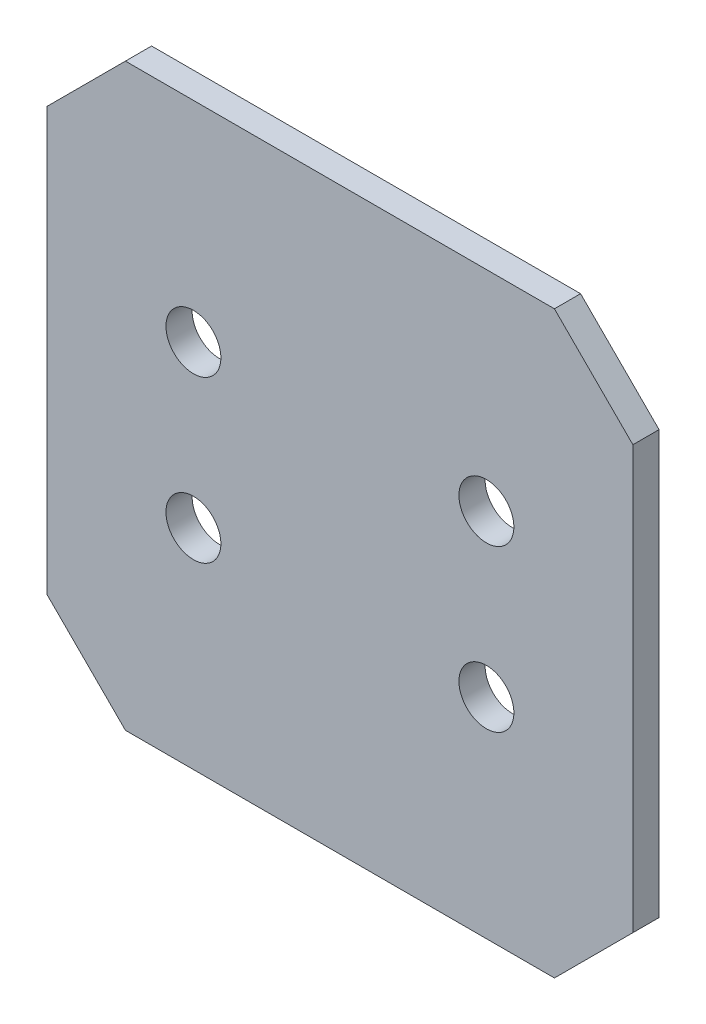
ISO-10303-21;
HEADER;
FILE_DESCRIPTION(('STEP AP214'),'2;1');
FILE_NAME('part.step','',(''),(''),'','','');
FILE_SCHEMA(('AUTOMOTIVE_DESIGN { 1 0 10303 214 1 1 1 1 }'));
ENDSEC;
DATA;
#1=APPLICATION_CONTEXT('core data for automotive mechanical design processes');
#2=APPLICATION_PROTOCOL_DEFINITION('international standard','automotive_design',2000,#1);
#3=PRODUCT_CONTEXT('',#1,'mechanical');
#4=PRODUCT('Part','Part','',(#3));
#5=PRODUCT_RELATED_PRODUCT_CATEGORY('part','',(#4));
#6=PRODUCT_DEFINITION_FORMATION('','',#4);
#7=PRODUCT_DEFINITION_CONTEXT('part definition',#1,'design');
#8=PRODUCT_DEFINITION('design','',#6,#7);
#9=PRODUCT_DEFINITION_SHAPE('','',#8);
#10=(LENGTH_UNIT() NAMED_UNIT(*) SI_UNIT(.MILLI.,.METRE.));
#11=(NAMED_UNIT(*) PLANE_ANGLE_UNIT() SI_UNIT($,.RADIAN.));
#12=(NAMED_UNIT(*) SI_UNIT($,.STERADIAN.) SOLID_ANGLE_UNIT());
#13=UNCERTAINTY_MEASURE_WITH_UNIT(LENGTH_MEASURE(1.E-05),#10,'distance_accuracy_value','');
#14=(GEOMETRIC_REPRESENTATION_CONTEXT(3) GLOBAL_UNCERTAINTY_ASSIGNED_CONTEXT((#13)) GLOBAL_UNIT_ASSIGNED_CONTEXT((#10,
#11,#12)) REPRESENTATION_CONTEXT('',''));
#15=CARTESIAN_POINT('',(0.,0.,0.));
#16=DIRECTION('',(0.,0.,1.));
#17=DIRECTION('',(1.,0.,0.));
#18=AXIS2_PLACEMENT_3D('',#15,#16,#17);
#19=CARTESIAN_POINT('',(55.999999999999,3.00000000000045,-5.));
#20=DIRECTION('',(1.,0.,0.));
#21=DIRECTION('',(0.,1.,0.));
#22=AXIS2_PLACEMENT_3D('',#19,#20,#21);
#23=PLANE('',#22);
#24=DIRECTION('',(0.,1.,0.));
#25=VECTOR('',#24,1.);
#26=CARTESIAN_POINT('',(55.999999999999,3.00000000000045,0.));
#27=LINE('',#26,#25);
#28=CARTESIAN_POINT('',(55.9999999999994,18.0000000000006,0.));
#29=VERTEX_POINT('',#28);
#30=CARTESIAN_POINT('',(55.9999999999988,98.7738106804795,0.));
#31=VERTEX_POINT('',#30);
#32=EDGE_CURVE('E162',#29,#31,#27,.T.);
#33=ORIENTED_EDGE('',*,*,#32,.F.);
#34=DIRECTION('',(0.,0.,-1.));
#35=VECTOR('',#34,1.);
#36=CARTESIAN_POINT('',(55.9999999999994,18.0000000000005,-5.));
#37=LINE('',#36,#35);
#38=CARTESIAN_POINT('',(55.9999999999994,18.0000000000005,-5.));
#39=VERTEX_POINT('',#38);
#40=EDGE_CURVE('E143',#29,#39,#37,.T.);
#41=ORIENTED_EDGE('',*,*,#40,.T.);
#42=DIRECTION('',(0.,1.,0.));
#43=VECTOR('',#42,1.);
#44=CARTESIAN_POINT('',(55.999999999999,3.00000000000045,-5.));
#45=LINE('',#44,#43);
#46=CARTESIAN_POINT('',(55.9999999999988,98.7738106804795,-5.));
#47=VERTEX_POINT('',#46);
#48=EDGE_CURVE('E124',#39,#47,#45,.T.);
#49=ORIENTED_EDGE('',*,*,#48,.T.);
#50=DIRECTION('',(0.,0.,1.));
#51=VECTOR('',#50,1.);
#52=CARTESIAN_POINT('',(55.9999999999988,98.7738106804795,-5.));
#53=LINE('',#52,#51);
#54=EDGE_CURVE('E140',#47,#31,#53,.T.);
#55=ORIENTED_EDGE('',*,*,#54,.T.);
#56=EDGE_LOOP('',(#33,#41,#49,#55));
#57=FACE_BOUND('',#56,.T.);
#58=ADVANCED_FACE('F38',(#57),#23,.T.);
#59=CARTESIAN_POINT('',(55.999999999999,3.00000000000045,-5.));
#60=DIRECTION('',(0.,-1.,0.));
#61=DIRECTION('',(1.,0.,0.));
#62=AXIS2_PLACEMENT_3D('',#59,#60,#61);
#63=PLANE('',#62);
#64=DIRECTION('',(1.,0.,0.));
#65=VECTOR('',#64,1.);
#66=CARTESIAN_POINT('',(55.999999999999,3.00000000000045,-5.));
#67=LINE('',#66,#65);
#68=CARTESIAN_POINT('',(-40.9999999999997,3.00000000000006,-5.));
#69=VERTEX_POINT('',#68);
#70=CARTESIAN_POINT('',(40.999999999999,3.00000000000038,-5.));
#71=VERTEX_POINT('',#70);
#72=EDGE_CURVE('E129',#69,#71,#67,.T.);
#73=ORIENTED_EDGE('',*,*,#72,.T.);
#74=DIRECTION('',(0.,0.,1.));
#75=VECTOR('',#74,1.);
#76=CARTESIAN_POINT('',(40.999999999999,3.00000000000038,-5.));
#77=LINE('',#76,#75);
#78=CARTESIAN_POINT('',(40.999999999999,3.0000000000004,0.));
#79=VERTEX_POINT('',#78);
#80=EDGE_CURVE('E123',#71,#79,#77,.T.);
#81=ORIENTED_EDGE('',*,*,#80,.T.);
#82=DIRECTION('',(1.,0.,0.));
#83=VECTOR('',#82,1.);
#84=CARTESIAN_POINT('',(55.999999999999,3.00000000000045,0.));
#85=LINE('',#84,#83);
#86=CARTESIAN_POINT('',(-40.9999999999997,3.00000000000006,0.));
#87=VERTEX_POINT('',#86);
#88=EDGE_CURVE('E106',#87,#79,#85,.T.);
#89=ORIENTED_EDGE('',*,*,#88,.F.);
#90=DIRECTION('',(0.,0.,-1.));
#91=VECTOR('',#90,1.);
#92=CARTESIAN_POINT('',(-40.9999999999997,3.00000000000006,-5.));
#93=LINE('',#92,#91);
#94=EDGE_CURVE('E120',#87,#69,#93,.T.);
#95=ORIENTED_EDGE('',*,*,#94,.T.);
#96=EDGE_LOOP('',(#73,#81,#89,#95));
#97=FACE_BOUND('',#96,.T.);
#98=ADVANCED_FACE('F119',(#97),#63,.T.);
#99=CARTESIAN_POINT('',(-55.9999999999996,3.,-5.));
#100=DIRECTION('',(-1.,0.,0.));
#101=DIRECTION('',(0.,0.,1.));
#102=AXIS2_PLACEMENT_3D('',#99,#100,#101);
#103=PLANE('',#102);
#104=DIRECTION('',(0.,-1.,0.));
#105=VECTOR('',#104,1.);
#106=CARTESIAN_POINT('',(-55.9999999999996,3.,-5.));
#107=LINE('',#106,#105);
#108=CARTESIAN_POINT('',(-55.9999999999994,98.773810680479,-5.));
#109=VERTEX_POINT('',#108);
#110=CARTESIAN_POINT('',(-55.9999999999996,17.9999999999999,-5.));
#111=VERTEX_POINT('',#110);
#112=EDGE_CURVE('E133',#109,#111,#107,.T.);
#113=ORIENTED_EDGE('',*,*,#112,.T.);
#114=DIRECTION('',(0.,0.,1.));
#115=VECTOR('',#114,1.);
#116=CARTESIAN_POINT('',(-55.9999999999996,17.9999999999999,-5.));
#117=LINE('',#116,#115);
#118=CARTESIAN_POINT('',(-55.9999999999997,17.9999999999999,0.));
#119=VERTEX_POINT('',#118);
#120=EDGE_CURVE('E153',#111,#119,#117,.T.);
#121=ORIENTED_EDGE('',*,*,#120,.T.);
#122=DIRECTION('',(0.,-1.,0.));
#123=VECTOR('',#122,1.);
#124=CARTESIAN_POINT('',(-55.9999999999997,3.,0.));
#125=LINE('',#124,#123);
#126=CARTESIAN_POINT('',(-55.9999999999994,98.7738106804791,0.));
#127=VERTEX_POINT('',#126);
#128=EDGE_CURVE('E108',#127,#119,#125,.T.);
#129=ORIENTED_EDGE('',*,*,#128,.F.);
#130=DIRECTION('',(0.,0.,-1.));
#131=VECTOR('',#130,1.);
#132=CARTESIAN_POINT('',(-55.9999999999994,98.773810680479,-5.));
#133=LINE('',#132,#131);
#134=EDGE_CURVE('E151',#127,#109,#133,.T.);
#135=ORIENTED_EDGE('',*,*,#134,.T.);
#136=EDGE_LOOP('',(#113,#121,#129,#135));
#137=FACE_BOUND('',#136,.T.);
#138=ADVANCED_FACE('F234',(#137),#103,.T.);
#139=CARTESIAN_POINT('',(-55.9999999999996,113.773810680479,-5.));
#140=DIRECTION('',(0.,1.,0.));
#141=DIRECTION('',(-1.,0.,0.));
#142=AXIS2_PLACEMENT_3D('',#139,#140,#141);
#143=PLANE('',#142);
#144=DIRECTION('',(-1.,0.,0.));
#145=VECTOR('',#144,1.);
#146=CARTESIAN_POINT('',(-55.9999999999996,113.773810680479,0.));
#147=LINE('',#146,#145);
#148=CARTESIAN_POINT('',(40.9999999999982,113.77381068048,0.));
#149=VERTEX_POINT('',#148);
#150=CARTESIAN_POINT('',(-40.9999999999996,113.773810680479,0.));
#151=VERTEX_POINT('',#150);
#152=EDGE_CURVE('E158',#149,#151,#147,.T.);
#153=ORIENTED_EDGE('',*,*,#152,.F.);
#154=DIRECTION('',(0.,0.,-1.));
#155=VECTOR('',#154,1.);
#156=CARTESIAN_POINT('',(40.9999999999982,113.77381068048,-5.));
#157=LINE('',#156,#155);
#158=CARTESIAN_POINT('',(40.9999999999982,113.77381068048,-5.));
#159=VERTEX_POINT('',#158);
#160=EDGE_CURVE('E11',#149,#159,#157,.T.);
#161=ORIENTED_EDGE('',*,*,#160,.T.);
#162=DIRECTION('',(-1.,0.,0.));
#163=VECTOR('',#162,1.);
#164=CARTESIAN_POINT('',(-55.9999999999996,113.773810680479,-5.));
#165=LINE('',#164,#163);
#166=CARTESIAN_POINT('',(-40.9999999999995,113.773810680479,-5.));
#167=VERTEX_POINT('',#166);
#168=EDGE_CURVE('E159',#159,#167,#165,.T.);
#169=ORIENTED_EDGE('',*,*,#168,.T.);
#170=DIRECTION('',(0.,0.,1.));
#171=VECTOR('',#170,1.);
#172=CARTESIAN_POINT('',(-40.9999999999995,113.773810680479,-5.));
#173=LINE('',#172,#171);
#174=EDGE_CURVE('E46',#167,#151,#173,.T.);
#175=ORIENTED_EDGE('',*,*,#174,.T.);
#176=EDGE_LOOP('',(#153,#161,#169,#175));
#177=FACE_BOUND('',#176,.T.);
#178=ADVANCED_FACE('F157',(#177),#143,.T.);
#179=CARTESIAN_POINT('',(0.,0.,-5.));
#180=DIRECTION('',(0.,0.,-1.));
#181=DIRECTION('',(-1.,0.,0.));
#182=AXIS2_PLACEMENT_3D('',#179,#180,#181);
#183=PLANE('',#182);
#184=CARTESIAN_POINT('',(27.9999999999997,43.,-5.));
#185=DIRECTION('',(0.,0.,1.));
#186=DIRECTION('',(-1.,0.,0.));
#187=AXIS2_PLACEMENT_3D('',#184,#185,#186);
#188=CIRCLE('',#187,5.25);
#189=CARTESIAN_POINT('',(22.7499999999997,43.,-5.));
#190=VERTEX_POINT('',#189);
#191=EDGE_CURVE('E187',#190,#190,#188,.T.);
#192=ORIENTED_EDGE('',*,*,#191,.T.);
#193=EDGE_LOOP('',(#192));
#194=FACE_BOUND('',#193,.T.);
#195=CARTESIAN_POINT('',(27.9999999999995,73.7738106804791,-5.));
#196=DIRECTION('',(0.,0.,1.));
#197=DIRECTION('',(-1.,0.,0.));
#198=AXIS2_PLACEMENT_3D('',#195,#196,#197);
#199=CIRCLE('',#198,5.25000000000001);
#200=CARTESIAN_POINT('',(22.7499999999995,73.7738106804791,-5.));
#201=VERTEX_POINT('',#200);
#202=EDGE_CURVE('E181',#201,#201,#199,.T.);
#203=ORIENTED_EDGE('',*,*,#202,.T.);
#204=EDGE_LOOP('',(#203));
#205=FACE_BOUND('',#204,.T.);
#206=CARTESIAN_POINT('',(-27.9999999999999,43.,-5.));
#207=DIRECTION('',(0.,0.,1.));
#208=DIRECTION('',(1.,0.,0.));
#209=AXIS2_PLACEMENT_3D('',#206,#207,#208);
#210=CIRCLE('',#209,5.25);
#211=CARTESIAN_POINT('',(-22.7499999999999,43.,-5.));
#212=VERTEX_POINT('',#211);
#213=EDGE_CURVE('E175',#212,#212,#210,.T.);
#214=ORIENTED_EDGE('',*,*,#213,.T.);
#215=EDGE_LOOP('',(#214));
#216=FACE_BOUND('',#215,.T.);
#217=CARTESIAN_POINT('',(-27.9999999999999,73.7738106804792,-5.));
#218=DIRECTION('',(0.,0.,1.));
#219=DIRECTION('',(1.,0.,0.));
#220=AXIS2_PLACEMENT_3D('',#217,#218,#219);
#221=CIRCLE('',#220,5.25);
#222=CARTESIAN_POINT('',(-22.7499999999999,73.7738106804792,-5.));
#223=VERTEX_POINT('',#222);
#224=EDGE_CURVE('E164',#223,#223,#221,.T.);
#225=ORIENTED_EDGE('',*,*,#224,.T.);
#226=EDGE_LOOP('',(#225));
#227=FACE_BOUND('',#226,.T.);
#228=ORIENTED_EDGE('',*,*,#48,.F.);
#229=DIRECTION('',(0.707106781186542,0.707106781186553,0.));
#230=VECTOR('',#229,1.);
#231=CARTESIAN_POINT('',(18.9999999999995,-18.9999999999996,-5.));
#232=LINE('',#231,#230);
#233=EDGE_CURVE('E149',#39,#71,#232,.F.);
#234=ORIENTED_EDGE('',*,*,#233,.T.);
#235=ORIENTED_EDGE('',*,*,#72,.F.);
#236=DIRECTION('',(0.707106781186552,-0.707106781186543,0.));
#237=VECTOR('',#236,1.);
#238=CARTESIAN_POINT('',(-18.9999999999999,-18.9999999999997,-5.));
#239=LINE('',#238,#237);
#240=EDGE_CURVE('E128',#69,#111,#239,.F.);
#241=ORIENTED_EDGE('',*,*,#240,.T.);
#242=ORIENTED_EDGE('',*,*,#112,.F.);
#243=DIRECTION('',(-0.707106781186546,-0.707106781186549,0.));
#244=VECTOR('',#243,1.);
#245=CARTESIAN_POINT('',(-77.3869053402395,77.3869053402391,-5.));
#246=LINE('',#245,#244);
#247=EDGE_CURVE('E53',#109,#167,#246,.F.);
#248=ORIENTED_EDGE('',*,*,#247,.T.);
#249=ORIENTED_EDGE('',*,*,#168,.F.);
#250=DIRECTION('',(-0.707106781186552,0.707106781186543,0.));
#251=VECTOR('',#250,1.);
#252=CARTESIAN_POINT('',(77.3869053402384,77.3869053402398,-5.));
#253=LINE('',#252,#251);
#254=EDGE_CURVE('E146',#159,#47,#253,.F.);
#255=ORIENTED_EDGE('',*,*,#254,.T.);
#256=EDGE_LOOP('',(#228,#234,#235,#241,#242,#248,#249,#255));
#257=FACE_BOUND('',#256,.T.);
#258=ADVANCED_FACE('F196',(#194,#205,#216,#227,#257),#183,.T.);
#259=CARTESIAN_POINT('',(0.,0.,0.));
#260=DIRECTION('',(0.,0.,-1.));
#261=DIRECTION('',(-1.,0.,0.));
#262=AXIS2_PLACEMENT_3D('',#259,#260,#261);
#263=PLANE('',#262);
#264=CARTESIAN_POINT('',(27.9999999999997,43.,0.));
#265=DIRECTION('',(0.,0.,1.));
#266=DIRECTION('',(-1.,0.,0.));
#267=AXIS2_PLACEMENT_3D('',#264,#265,#266);
#268=CIRCLE('',#267,5.25);
#269=CARTESIAN_POINT('',(22.7499999999997,43.,0.));
#270=VERTEX_POINT('',#269);
#271=EDGE_CURVE('E190',#270,#270,#268,.T.);
#272=ORIENTED_EDGE('',*,*,#271,.F.);
#273=EDGE_LOOP('',(#272));
#274=FACE_BOUND('',#273,.T.);
#275=CARTESIAN_POINT('',(27.9999999999995,73.7738106804791,0.));
#276=DIRECTION('',(0.,0.,1.));
#277=DIRECTION('',(-1.,0.,0.));
#278=AXIS2_PLACEMENT_3D('',#275,#276,#277);
#279=CIRCLE('',#278,5.25000000000001);
#280=CARTESIAN_POINT('',(22.7499999999995,73.7738106804791,0.));
#281=VERTEX_POINT('',#280);
#282=EDGE_CURVE('E184',#281,#281,#279,.T.);
#283=ORIENTED_EDGE('',*,*,#282,.F.);
#284=EDGE_LOOP('',(#283));
#285=FACE_BOUND('',#284,.T.);
#286=CARTESIAN_POINT('',(-27.9999999999999,43.,0.));
#287=DIRECTION('',(0.,0.,1.));
#288=DIRECTION('',(1.,0.,0.));
#289=AXIS2_PLACEMENT_3D('',#286,#287,#288);
#290=CIRCLE('',#289,5.25);
#291=CARTESIAN_POINT('',(-22.7499999999999,43.,0.));
#292=VERTEX_POINT('',#291);
#293=EDGE_CURVE('E178',#292,#292,#290,.T.);
#294=ORIENTED_EDGE('',*,*,#293,.F.);
#295=EDGE_LOOP('',(#294));
#296=FACE_BOUND('',#295,.T.);
#297=CARTESIAN_POINT('',(-27.9999999999999,73.7738106804792,0.));
#298=DIRECTION('',(0.,0.,1.));
#299=DIRECTION('',(1.,0.,0.));
#300=AXIS2_PLACEMENT_3D('',#297,#298,#299);
#301=CIRCLE('',#300,5.25);
#302=CARTESIAN_POINT('',(-22.7499999999999,73.7738106804792,0.));
#303=VERTEX_POINT('',#302);
#304=EDGE_CURVE('E172',#303,#303,#301,.T.);
#305=ORIENTED_EDGE('',*,*,#304,.F.);
#306=EDGE_LOOP('',(#305));
#307=FACE_BOUND('',#306,.T.);
#308=ORIENTED_EDGE('',*,*,#88,.T.);
#309=DIRECTION('',(-0.707106781186542,-0.707106781186553,0.));
#310=VECTOR('',#309,1.);
#311=CARTESIAN_POINT('',(40.999999999999,3.0000000000004,0.));
#312=LINE('',#311,#310);
#313=EDGE_CURVE('E113',#79,#29,#312,.F.);
#314=ORIENTED_EDGE('',*,*,#313,.T.);
#315=ORIENTED_EDGE('',*,*,#32,.T.);
#316=DIRECTION('',(0.707106781186552,-0.707106781186543,0.));
#317=VECTOR('',#316,1.);
#318=CARTESIAN_POINT('',(55.9999999999988,98.7738106804795,0.));
#319=LINE('',#318,#317);
#320=EDGE_CURVE('E114',#31,#149,#319,.F.);
#321=ORIENTED_EDGE('',*,*,#320,.T.);
#322=ORIENTED_EDGE('',*,*,#152,.T.);
#323=DIRECTION('',(0.707106781186546,0.707106781186549,0.));
#324=VECTOR('',#323,1.);
#325=CARTESIAN_POINT('',(-40.9999999999996,113.773810680479,0.));
#326=LINE('',#325,#324);
#327=EDGE_CURVE('E131',#151,#127,#326,.F.);
#328=ORIENTED_EDGE('',*,*,#327,.T.);
#329=ORIENTED_EDGE('',*,*,#128,.T.);
#330=DIRECTION('',(-0.707106781186552,0.707106781186543,0.));
#331=VECTOR('',#330,1.);
#332=CARTESIAN_POINT('',(-55.9999999999997,17.9999999999999,0.));
#333=LINE('',#332,#331);
#334=EDGE_CURVE('E103',#119,#87,#333,.F.);
#335=ORIENTED_EDGE('',*,*,#334,.T.);
#336=EDGE_LOOP('',(#308,#314,#315,#321,#322,#328,#329,#335));
#337=FACE_BOUND('',#336,.T.);
#338=ADVANCED_FACE('F105',(#274,#285,#296,#307,#337),#263,.F.);
#339=CARTESIAN_POINT('',(-27.9999999999999,73.7738106804792,-5.));
#340=DIRECTION('',(0.,0.,1.));
#341=DIRECTION('',(1.,0.,0.));
#342=AXIS2_PLACEMENT_3D('',#339,#340,#341);
#343=CYLINDRICAL_SURFACE('',#342,5.25);
#344=ORIENTED_EDGE('',*,*,#224,.F.);
#345=EDGE_LOOP('',(#344));
#346=FACE_BOUND('',#345,.T.);
#347=ORIENTED_EDGE('',*,*,#304,.T.);
#348=EDGE_LOOP('',(#347));
#349=FACE_BOUND('',#348,.T.);
#350=ADVANCED_FACE('F209',(#346,#349),#343,.F.);
#351=CARTESIAN_POINT('',(-27.9999999999999,43.,-5.));
#352=DIRECTION('',(0.,0.,1.));
#353=DIRECTION('',(1.,0.,0.));
#354=AXIS2_PLACEMENT_3D('',#351,#352,#353);
#355=CYLINDRICAL_SURFACE('',#354,5.25);
#356=ORIENTED_EDGE('',*,*,#213,.F.);
#357=EDGE_LOOP('',(#356));
#358=FACE_BOUND('',#357,.T.);
#359=ORIENTED_EDGE('',*,*,#293,.T.);
#360=EDGE_LOOP('',(#359));
#361=FACE_BOUND('',#360,.T.);
#362=ADVANCED_FACE('F218',(#358,#361),#355,.F.);
#363=CARTESIAN_POINT('',(27.9999999999995,73.7738106804791,-5.));
#364=DIRECTION('',(0.,0.,1.));
#365=DIRECTION('',(1.,0.,0.));
#366=AXIS2_PLACEMENT_3D('',#363,#364,#365);
#367=CYLINDRICAL_SURFACE('',#366,5.25000000000001);
#368=ORIENTED_EDGE('',*,*,#202,.F.);
#369=EDGE_LOOP('',(#368));
#370=FACE_BOUND('',#369,.T.);
#371=ORIENTED_EDGE('',*,*,#282,.T.);
#372=EDGE_LOOP('',(#371));
#373=FACE_BOUND('',#372,.T.);
#374=ADVANCED_FACE('F203',(#370,#373),#367,.F.);
#375=CARTESIAN_POINT('',(27.9999999999997,43.,-5.));
#376=DIRECTION('',(0.,0.,1.));
#377=DIRECTION('',(1.,0.,0.));
#378=AXIS2_PLACEMENT_3D('',#375,#376,#377);
#379=CYLINDRICAL_SURFACE('',#378,5.25);
#380=ORIENTED_EDGE('',*,*,#191,.F.);
#381=EDGE_LOOP('',(#380));
#382=FACE_BOUND('',#381,.T.);
#383=ORIENTED_EDGE('',*,*,#271,.T.);
#384=EDGE_LOOP('',(#383));
#385=FACE_BOUND('',#384,.T.);
#386=ADVANCED_FACE('F199',(#382,#385),#379,.F.);
#387=CARTESIAN_POINT('',(40.999999999999,3.00000000000038,-5.));
#388=DIRECTION('',(-0.707106781186553,0.707106781186542,0.));
#389=DIRECTION('',(0.,0.,1.));
#390=AXIS2_PLACEMENT_3D('',#387,#388,#389);
#391=PLANE('',#390);
#392=ORIENTED_EDGE('',*,*,#233,.F.);
#393=ORIENTED_EDGE('',*,*,#40,.F.);
#394=ORIENTED_EDGE('',*,*,#313,.F.);
#395=ORIENTED_EDGE('',*,*,#80,.F.);
#396=EDGE_LOOP('',(#392,#393,#394,#395));
#397=FACE_BOUND('',#396,.T.);
#398=ADVANCED_FACE('F202',(#397),#391,.F.);
#399=CARTESIAN_POINT('',(-55.9999999999996,17.9999999999999,-5.));
#400=DIRECTION('',(0.707106781186543,0.707106781186552,0.));
#401=DIRECTION('',(0.,0.,1.));
#402=AXIS2_PLACEMENT_3D('',#399,#400,#401);
#403=PLANE('',#402);
#404=ORIENTED_EDGE('',*,*,#240,.F.);
#405=ORIENTED_EDGE('',*,*,#94,.F.);
#406=ORIENTED_EDGE('',*,*,#334,.F.);
#407=ORIENTED_EDGE('',*,*,#120,.F.);
#408=EDGE_LOOP('',(#404,#405,#406,#407));
#409=FACE_BOUND('',#408,.T.);
#410=ADVANCED_FACE('F127',(#409),#403,.F.);
#411=CARTESIAN_POINT('',(55.9999999999988,98.7738106804795,-5.));
#412=DIRECTION('',(-0.707106781186543,-0.707106781186552,0.));
#413=DIRECTION('',(0.,0.,1.));
#414=AXIS2_PLACEMENT_3D('',#411,#412,#413);
#415=PLANE('',#414);
#416=ORIENTED_EDGE('',*,*,#254,.F.);
#417=ORIENTED_EDGE('',*,*,#160,.F.);
#418=ORIENTED_EDGE('',*,*,#320,.F.);
#419=ORIENTED_EDGE('',*,*,#54,.F.);
#420=EDGE_LOOP('',(#416,#417,#418,#419));
#421=FACE_BOUND('',#420,.T.);
#422=ADVANCED_FACE('F244',(#421),#415,.F.);
#423=CARTESIAN_POINT('',(-40.9999999999995,113.773810680479,-5.));
#424=DIRECTION('',(0.707106781186549,-0.707106781186546,0.));
#425=DIRECTION('',(0.,0.,1.));
#426=AXIS2_PLACEMENT_3D('',#423,#424,#425);
#427=PLANE('',#426);
#428=ORIENTED_EDGE('',*,*,#247,.F.);
#429=ORIENTED_EDGE('',*,*,#134,.F.);
#430=ORIENTED_EDGE('',*,*,#327,.F.);
#431=ORIENTED_EDGE('',*,*,#174,.F.);
#432=EDGE_LOOP('',(#428,#429,#430,#431));
#433=FACE_BOUND('',#432,.T.);
#434=ADVANCED_FACE('F40',(#433),#427,.F.);
#435=CLOSED_SHELL('',(#58,#98,#138,#178,#258,#338,#350,#362,#374,#386,#398,#410,#422,#434));
#436=MANIFOLD_SOLID_BREP('B2',#435);
#437=ADVANCED_BREP_SHAPE_REPRESENTATION('',(#18,#436),#14);
#438=SHAPE_DEFINITION_REPRESENTATION(#9,#437);
ENDSEC;
END-ISO-10303-21;
